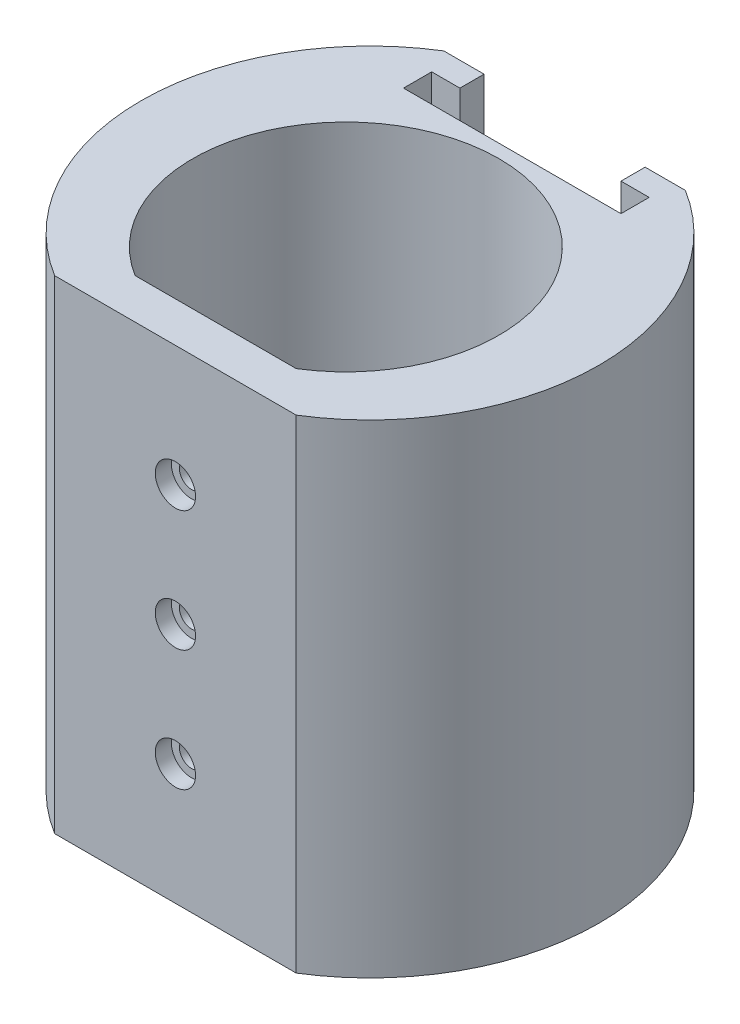
ISO-10303-21;
HEADER;
FILE_DESCRIPTION(('STEP AP214'),'2;1');
FILE_NAME('part.step','',(''),(''),'','','');
FILE_SCHEMA(('AUTOMOTIVE_DESIGN { 1 0 10303 214 1 1 1 1 }'));
ENDSEC;
DATA;
#1=APPLICATION_CONTEXT('core data for automotive mechanical design processes');
#2=APPLICATION_PROTOCOL_DEFINITION('international standard','automotive_design',2000,#1);
#3=PRODUCT_CONTEXT('',#1,'mechanical');
#4=PRODUCT('Part','Part','',(#3));
#5=PRODUCT_RELATED_PRODUCT_CATEGORY('part','',(#4));
#6=PRODUCT_DEFINITION_FORMATION('','',#4);
#7=PRODUCT_DEFINITION_CONTEXT('part definition',#1,'design');
#8=PRODUCT_DEFINITION('design','',#6,#7);
#9=PRODUCT_DEFINITION_SHAPE('','',#8);
#10=(LENGTH_UNIT() NAMED_UNIT(*) SI_UNIT(.MILLI.,.METRE.));
#11=(NAMED_UNIT(*) PLANE_ANGLE_UNIT() SI_UNIT($,.RADIAN.));
#12=(NAMED_UNIT(*) SI_UNIT($,.STERADIAN.) SOLID_ANGLE_UNIT());
#13=UNCERTAINTY_MEASURE_WITH_UNIT(LENGTH_MEASURE(1.E-05),#10,'distance_accuracy_value','');
#14=(GEOMETRIC_REPRESENTATION_CONTEXT(3) GLOBAL_UNCERTAINTY_ASSIGNED_CONTEXT((#13)) GLOBAL_UNIT_ASSIGNED_CONTEXT((#10,
#11,#12)) REPRESENTATION_CONTEXT('',''));
#15=CARTESIAN_POINT('',(0.,0.,0.));
#16=DIRECTION('',(0.,0.,1.));
#17=DIRECTION('',(1.,0.,0.));
#18=AXIS2_PLACEMENT_3D('',#15,#16,#17);
#19=CARTESIAN_POINT('',(0.,-15.,11.9187337903192));
#20=DIRECTION('',(0.,0.,1.));
#21=DIRECTION('',(1.,0.,0.));
#22=AXIS2_PLACEMENT_3D('',#19,#20,#21);
#23=CYLINDRICAL_SURFACE('',#22,1.5);
#24=CARTESIAN_POINT('',(0.,-15.,16.1613744774385));
#25=DIRECTION('',(0.,0.,-1.));
#26=DIRECTION('',(-1.,0.,0.));
#27=AXIS2_PLACEMENT_3D('',#24,#25,#26);
#28=CIRCLE('',#27,1.5);
#29=CARTESIAN_POINT('',(-1.5,-15.,16.1613744774385));
#30=VERTEX_POINT('',#29);
#31=EDGE_CURVE('E279',#30,#30,#28,.F.);
#32=ORIENTED_EDGE('',*,*,#31,.F.);
#33=EDGE_LOOP('',(#32));
#34=FACE_BOUND('',#33,.T.);
#35=CARTESIAN_POINT('',(0.,-15.,19.1613744774385));
#36=DIRECTION('',(0.,0.,1.));
#37=DIRECTION('',(1.,0.,0.));
#38=AXIS2_PLACEMENT_3D('',#35,#36,#37);
#39=CIRCLE('',#38,1.5);
#40=CARTESIAN_POINT('',(1.5,-15.,19.1613744774385));
#41=VERTEX_POINT('',#40);
#42=EDGE_CURVE('E288',#41,#41,#39,.T.);
#43=ORIENTED_EDGE('',*,*,#42,.T.);
#44=EDGE_LOOP('',(#43));
#45=FACE_BOUND('',#44,.T.);
#46=ADVANCED_FACE('F41',(#34,#45),#23,.F.);
#47=CARTESIAN_POINT('',(0.,15.,11.9187337903192));
#48=DIRECTION('',(0.,0.,1.));
#49=DIRECTION('',(1.,0.,0.));
#50=AXIS2_PLACEMENT_3D('',#47,#48,#49);
#51=CYLINDRICAL_SURFACE('',#50,1.5);
#52=CARTESIAN_POINT('',(0.,15.,16.1613744774385));
#53=DIRECTION('',(0.,0.,-1.));
#54=DIRECTION('',(-1.,0.,0.));
#55=AXIS2_PLACEMENT_3D('',#52,#53,#54);
#56=CIRCLE('',#55,1.5);
#57=CARTESIAN_POINT('',(-1.5,15.,16.1613744774385));
#58=VERTEX_POINT('',#57);
#59=EDGE_CURVE('E274',#58,#58,#56,.F.);
#60=ORIENTED_EDGE('',*,*,#59,.F.);
#61=EDGE_LOOP('',(#60));
#62=FACE_BOUND('',#61,.T.);
#63=CARTESIAN_POINT('',(0.,15.,19.1613744774385));
#64=DIRECTION('',(0.,0.,1.));
#65=DIRECTION('',(1.,0.,0.));
#66=AXIS2_PLACEMENT_3D('',#63,#64,#65);
#67=CIRCLE('',#66,1.5);
#68=CARTESIAN_POINT('',(1.5,15.,19.1613744774385));
#69=VERTEX_POINT('',#68);
#70=EDGE_CURVE('E297',#69,#69,#67,.T.);
#71=ORIENTED_EDGE('',*,*,#70,.T.);
#72=EDGE_LOOP('',(#71));
#73=FACE_BOUND('',#72,.T.);
#74=ADVANCED_FACE('F303',(#62,#73),#51,.F.);
#75=CARTESIAN_POINT('',(0.,0.,11.9187337903192));
#76=DIRECTION('',(0.,0.,1.));
#77=DIRECTION('',(1.,0.,0.));
#78=AXIS2_PLACEMENT_3D('',#75,#76,#77);
#79=CYLINDRICAL_SURFACE('',#78,1.5);
#80=CARTESIAN_POINT('',(0.,0.,16.1613744774385));
#81=DIRECTION('',(0.,0.,-1.));
#82=DIRECTION('',(-1.,0.,0.));
#83=AXIS2_PLACEMENT_3D('',#80,#81,#82);
#84=CIRCLE('',#83,1.5);
#85=CARTESIAN_POINT('',(-1.5,0.,16.1613744774385));
#86=VERTEX_POINT('',#85);
#87=EDGE_CURVE('E167',#86,#86,#84,.F.);
#88=ORIENTED_EDGE('',*,*,#87,.F.);
#89=EDGE_LOOP('',(#88));
#90=FACE_BOUND('',#89,.T.);
#91=CARTESIAN_POINT('',(0.,0.,19.1613744774385));
#92=DIRECTION('',(0.,0.,1.));
#93=DIRECTION('',(1.,0.,0.));
#94=AXIS2_PLACEMENT_3D('',#91,#92,#93);
#95=CIRCLE('',#94,1.5);
#96=CARTESIAN_POINT('',(1.5,0.,19.1613744774385));
#97=VERTEX_POINT('',#96);
#98=EDGE_CURVE('E273',#97,#97,#95,.T.);
#99=ORIENTED_EDGE('',*,*,#98,.T.);
#100=EDGE_LOOP('',(#99));
#101=FACE_BOUND('',#100,.T.);
#102=ADVANCED_FACE('F365',(#90,#101),#79,.F.);
#103=CARTESIAN_POINT('',(0.,30.,-3.));
#104=DIRECTION('',(0.,1.,0.));
#105=DIRECTION('',(0.,0.,1.));
#106=AXIS2_PLACEMENT_3D('',#103,#104,#105);
#107=PLANE('',#106);
#108=DIRECTION('',(0.,0.,-1.));
#109=VECTOR('',#108,1.);
#110=CARTESIAN_POINT('',(10.,30.,-24.1613744774385));
#111=LINE('',#110,#109);
#112=CARTESIAN_POINT('',(10.,30.,-24.1613744774385));
#113=VERTEX_POINT('',#112);
#114=CARTESIAN_POINT('',(10.,30.,-27.1613744774385));
#115=VERTEX_POINT('',#114);
#116=EDGE_CURVE('E155',#113,#115,#111,.T.);
#117=ORIENTED_EDGE('',*,*,#116,.F.);
#118=DIRECTION('',(-1.,0.,0.));
#119=VECTOR('',#118,1.);
#120=CARTESIAN_POINT('',(13.5,30.,-24.1613744774385));
#121=LINE('',#120,#119);
#122=CARTESIAN_POINT('',(13.5,30.,-24.1613744774385));
#123=VERTEX_POINT('',#122);
#124=EDGE_CURVE('E242',#123,#113,#121,.T.);
#125=ORIENTED_EDGE('',*,*,#124,.F.);
#126=DIRECTION('',(0.,0.,-1.));
#127=VECTOR('',#126,1.);
#128=CARTESIAN_POINT('',(13.5,30.,-20.6613744774385));
#129=LINE('',#128,#127);
#130=CARTESIAN_POINT('',(13.5,30.,-20.6613744774385));
#131=VERTEX_POINT('',#130);
#132=EDGE_CURVE('E245',#131,#123,#129,.T.);
#133=ORIENTED_EDGE('',*,*,#132,.F.);
#134=DIRECTION('',(1.,0.,0.));
#135=VECTOR('',#134,1.);
#136=CARTESIAN_POINT('',(-13.5,30.,-20.6613744774385));
#137=LINE('',#136,#135);
#138=CARTESIAN_POINT('',(-13.5,30.,-20.6613744774385));
#139=VERTEX_POINT('',#138);
#140=EDGE_CURVE('E248',#139,#131,#137,.T.);
#141=ORIENTED_EDGE('',*,*,#140,.F.);
#142=DIRECTION('',(0.,0.,1.));
#143=VECTOR('',#142,1.);
#144=CARTESIAN_POINT('',(-13.5,30.,-24.1613744774385));
#145=LINE('',#144,#143);
#146=CARTESIAN_POINT('',(-13.5,30.,-24.1613744774385));
#147=VERTEX_POINT('',#146);
#148=EDGE_CURVE('E251',#147,#139,#145,.T.);
#149=ORIENTED_EDGE('',*,*,#148,.F.);
#150=DIRECTION('',(-1.,0.,0.));
#151=VECTOR('',#150,1.);
#152=CARTESIAN_POINT('',(-10.,30.,-24.1613744774385));
#153=LINE('',#152,#151);
#154=CARTESIAN_POINT('',(-10.,30.,-24.1613744774385));
#155=VERTEX_POINT('',#154);
#156=EDGE_CURVE('E166',#155,#147,#153,.T.);
#157=ORIENTED_EDGE('',*,*,#156,.F.);
#158=DIRECTION('',(0.,0.,1.));
#159=VECTOR('',#158,1.);
#160=CARTESIAN_POINT('',(-10.,30.,-27.1613744774385));
#161=LINE('',#160,#159);
#162=CARTESIAN_POINT('',(-10.,30.,-27.1613744774385));
#163=VERTEX_POINT('',#162);
#164=EDGE_CURVE('E146',#163,#155,#161,.T.);
#165=ORIENTED_EDGE('',*,*,#164,.F.);
#166=DIRECTION('',(-1.,0.,0.));
#167=VECTOR('',#166,1.);
#168=CARTESIAN_POINT('',(-15.,30.,-27.1613744774385));
#169=LINE('',#168,#167);
#170=CARTESIAN_POINT('',(-15.,30.,-27.1613744774385));
#171=VERTEX_POINT('',#170);
#172=EDGE_CURVE('E162',#163,#171,#169,.T.);
#173=ORIENTED_EDGE('',*,*,#172,.T.);
#174=CARTESIAN_POINT('',(0.,30.,-3.));
#175=DIRECTION('',(0.,1.,0.));
#176=DIRECTION('',(0.,0.,1.));
#177=AXIS2_PLACEMENT_3D('',#174,#175,#176);
#178=CIRCLE('',#177,28.4389172902031);
#179=CARTESIAN_POINT('',(-15.,30.,21.1613744774385));
#180=VERTEX_POINT('',#179);
#181=EDGE_CURVE('E190',#171,#180,#178,.T.);
#182=ORIENTED_EDGE('',*,*,#181,.T.);
#183=DIRECTION('',(1.,0.,0.));
#184=VECTOR('',#183,1.);
#185=CARTESIAN_POINT('',(-15.,30.,21.1613744774385));
#186=LINE('',#185,#184);
#187=CARTESIAN_POINT('',(15.,30.,21.1613744774385));
#188=VERTEX_POINT('',#187);
#189=EDGE_CURVE('E177',#180,#188,#186,.T.);
#190=ORIENTED_EDGE('',*,*,#189,.T.);
#191=CARTESIAN_POINT('',(0.,30.,-3.));
#192=DIRECTION('',(0.,1.,0.));
#193=DIRECTION('',(0.,0.,1.));
#194=AXIS2_PLACEMENT_3D('',#191,#192,#193);
#195=CIRCLE('',#194,28.4389172902031);
#196=CARTESIAN_POINT('',(15.,30.,-27.1613744774385));
#197=VERTEX_POINT('',#196);
#198=EDGE_CURVE('E174',#188,#197,#195,.T.);
#199=ORIENTED_EDGE('',*,*,#198,.T.);
#200=EDGE_CURVE('E173',#197,#115,#169,.T.);
#201=ORIENTED_EDGE('',*,*,#200,.T.);
#202=EDGE_LOOP('',(#117,#125,#133,#141,#149,#157,#165,#173,#182,#190,#199,#201));
#203=FACE_BOUND('',#202,.T.);
#204=DIRECTION('',(1.,0.,0.));
#205=VECTOR('',#204,1.);
#206=CARTESIAN_POINT('',(-10.,30.,16.1613744774385));
#207=LINE('',#206,#205);
#208=CARTESIAN_POINT('',(-10.,30.,16.1613744774385));
#209=VERTEX_POINT('',#208);
#210=CARTESIAN_POINT('',(10.,30.,16.1613744774385));
#211=VERTEX_POINT('',#210);
#212=EDGE_CURVE('E216',#209,#211,#207,.T.);
#213=ORIENTED_EDGE('',*,*,#212,.F.);
#214=CARTESIAN_POINT('',(0.,30.,0.));
#215=DIRECTION('',(0.,1.,0.));
#216=DIRECTION('',(0.,0.,1.));
#217=AXIS2_PLACEMENT_3D('',#214,#215,#216);
#218=CIRCLE('',#217,19.005);
#219=EDGE_CURVE('E220',#211,#209,#218,.T.);
#220=ORIENTED_EDGE('',*,*,#219,.F.);
#221=EDGE_LOOP('',(#213,#220));
#222=FACE_BOUND('',#221,.T.);
#223=ADVANCED_FACE('F159',(#203,#222),#107,.T.);
#224=CARTESIAN_POINT('',(0.,-30.,-3.));
#225=DIRECTION('',(0.,1.,0.));
#226=DIRECTION('',(0.,0.,1.));
#227=AXIS2_PLACEMENT_3D('',#224,#225,#226);
#228=PLANE('',#227);
#229=CARTESIAN_POINT('',(0.,-30.,-3.));
#230=DIRECTION('',(0.,1.,0.));
#231=DIRECTION('',(0.,0.,1.));
#232=AXIS2_PLACEMENT_3D('',#229,#230,#231);
#233=CIRCLE('',#232,28.4389172902031);
#234=CARTESIAN_POINT('',(-15.,-30.,-27.1613744774385));
#235=VERTEX_POINT('',#234);
#236=CARTESIAN_POINT('',(-15.,-30.,21.1613744774385));
#237=VERTEX_POINT('',#236);
#238=EDGE_CURVE('E181',#235,#237,#233,.T.);
#239=ORIENTED_EDGE('',*,*,#238,.F.);
#240=DIRECTION('',(-1.,0.,0.));
#241=VECTOR('',#240,1.);
#242=CARTESIAN_POINT('',(-15.,-30.,-27.1613744774385));
#243=LINE('',#242,#241);
#244=CARTESIAN_POINT('',(15.,-30.,-27.1613744774385));
#245=VERTEX_POINT('',#244);
#246=EDGE_CURVE('E188',#245,#235,#243,.T.);
#247=ORIENTED_EDGE('',*,*,#246,.F.);
#248=CARTESIAN_POINT('',(0.,-30.,-3.));
#249=DIRECTION('',(0.,1.,0.));
#250=DIRECTION('',(0.,0.,1.));
#251=AXIS2_PLACEMENT_3D('',#248,#249,#250);
#252=CIRCLE('',#251,28.4389172902031);
#253=CARTESIAN_POINT('',(15.,-30.,21.1613744774385));
#254=VERTEX_POINT('',#253);
#255=EDGE_CURVE('E186',#254,#245,#252,.T.);
#256=ORIENTED_EDGE('',*,*,#255,.F.);
#257=DIRECTION('',(1.,0.,0.));
#258=VECTOR('',#257,1.);
#259=CARTESIAN_POINT('',(-15.,-30.,21.1613744774385));
#260=LINE('',#259,#258);
#261=EDGE_CURVE('E184',#237,#254,#260,.T.);
#262=ORIENTED_EDGE('',*,*,#261,.F.);
#263=EDGE_LOOP('',(#239,#247,#256,#262));
#264=FACE_BOUND('',#263,.T.);
#265=CARTESIAN_POINT('',(0.,-30.,0.));
#266=DIRECTION('',(0.,1.,0.));
#267=DIRECTION('',(0.,0.,1.));
#268=AXIS2_PLACEMENT_3D('',#265,#266,#267);
#269=CIRCLE('',#268,19.005);
#270=CARTESIAN_POINT('',(10.,-30.,16.1613744774385));
#271=VERTEX_POINT('',#270);
#272=CARTESIAN_POINT('',(-10.,-30.,16.1613744774385));
#273=VERTEX_POINT('',#272);
#274=EDGE_CURVE('E221',#271,#273,#269,.T.);
#275=ORIENTED_EDGE('',*,*,#274,.T.);
#276=DIRECTION('',(1.,0.,0.));
#277=VECTOR('',#276,1.);
#278=CARTESIAN_POINT('',(-10.,-30.,16.1613744774385));
#279=LINE('',#278,#277);
#280=EDGE_CURVE('E217',#273,#271,#279,.T.);
#281=ORIENTED_EDGE('',*,*,#280,.T.);
#282=EDGE_LOOP('',(#275,#281));
#283=FACE_BOUND('',#282,.T.);
#284=ADVANCED_FACE('F205',(#264,#283),#228,.F.);
#285=CARTESIAN_POINT('',(0.,30.,-3.));
#286=DIRECTION('',(0.,-1.,0.));
#287=DIRECTION('',(0.,0.,-1.));
#288=AXIS2_PLACEMENT_3D('',#285,#286,#287);
#289=CYLINDRICAL_SURFACE('',#288,28.4389172902031);
#290=ORIENTED_EDGE('',*,*,#238,.T.);
#291=DIRECTION('',(0.,-1.,0.));
#292=VECTOR('',#291,1.);
#293=CARTESIAN_POINT('',(-15.,30.,21.1613744774385));
#294=LINE('',#293,#292);
#295=EDGE_CURVE('E12',#180,#237,#294,.T.);
#296=ORIENTED_EDGE('',*,*,#295,.F.);
#297=ORIENTED_EDGE('',*,*,#181,.F.);
#298=DIRECTION('',(0.,-1.,0.));
#299=VECTOR('',#298,1.);
#300=CARTESIAN_POINT('',(-15.,30.,-27.1613744774385));
#301=LINE('',#300,#299);
#302=EDGE_CURVE('E171',#171,#235,#301,.T.);
#303=ORIENTED_EDGE('',*,*,#302,.T.);
#304=EDGE_LOOP('',(#290,#296,#297,#303));
#305=FACE_BOUND('',#304,.T.);
#306=ADVANCED_FACE('F43',(#305),#289,.T.);
#307=CARTESIAN_POINT('',(-15.,30.,21.1613744774385));
#308=DIRECTION('',(0.,0.,-1.));
#309=DIRECTION('',(-1.,0.,0.));
#310=AXIS2_PLACEMENT_3D('',#307,#308,#309);
#311=PLANE('',#310);
#312=CARTESIAN_POINT('',(0.,15.,21.1613744774385));
#313=DIRECTION('',(0.,0.,1.));
#314=DIRECTION('',(1.,0.,0.));
#315=AXIS2_PLACEMENT_3D('',#312,#313,#314);
#316=CIRCLE('',#315,2.5);
#317=CARTESIAN_POINT('',(2.5,15.,21.1613744774385));
#318=VERTEX_POINT('',#317);
#319=EDGE_CURVE('E292',#318,#318,#316,.T.);
#320=ORIENTED_EDGE('',*,*,#319,.F.);
#321=EDGE_LOOP('',(#320));
#322=FACE_BOUND('',#321,.T.);
#323=CARTESIAN_POINT('',(0.,-15.,21.1613744774385));
#324=DIRECTION('',(0.,0.,1.));
#325=DIRECTION('',(1.,0.,0.));
#326=AXIS2_PLACEMENT_3D('',#323,#324,#325);
#327=CIRCLE('',#326,2.5);
#328=CARTESIAN_POINT('',(2.5,-15.,21.1613744774385));
#329=VERTEX_POINT('',#328);
#330=EDGE_CURVE('E285',#329,#329,#327,.T.);
#331=ORIENTED_EDGE('',*,*,#330,.F.);
#332=EDGE_LOOP('',(#331));
#333=FACE_BOUND('',#332,.T.);
#334=CARTESIAN_POINT('',(0.,0.,21.1613744774385));
#335=DIRECTION('',(0.,0.,1.));
#336=DIRECTION('',(1.,0.,0.));
#337=AXIS2_PLACEMENT_3D('',#334,#335,#336);
#338=CIRCLE('',#337,2.5);
#339=CARTESIAN_POINT('',(2.5,0.,21.1613744774385));
#340=VERTEX_POINT('',#339);
#341=EDGE_CURVE('E270',#340,#340,#338,.T.);
#342=ORIENTED_EDGE('',*,*,#341,.F.);
#343=EDGE_LOOP('',(#342));
#344=FACE_BOUND('',#343,.T.);
#345=ORIENTED_EDGE('',*,*,#261,.T.);
#346=DIRECTION('',(0.,-1.,0.));
#347=VECTOR('',#346,1.);
#348=CARTESIAN_POINT('',(15.,30.,21.1613744774385));
#349=LINE('',#348,#347);
#350=EDGE_CURVE('E49',#188,#254,#349,.T.);
#351=ORIENTED_EDGE('',*,*,#350,.F.);
#352=ORIENTED_EDGE('',*,*,#189,.F.);
#353=ORIENTED_EDGE('',*,*,#295,.T.);
#354=EDGE_LOOP('',(#345,#351,#352,#353));
#355=FACE_BOUND('',#354,.T.);
#356=ADVANCED_FACE('F319',(#322,#333,#344,#355),#311,.F.);
#357=CARTESIAN_POINT('',(0.,30.,-3.));
#358=DIRECTION('',(0.,-1.,0.));
#359=DIRECTION('',(0.,0.,-1.));
#360=AXIS2_PLACEMENT_3D('',#357,#358,#359);
#361=CYLINDRICAL_SURFACE('',#360,28.4389172902031);
#362=ORIENTED_EDGE('',*,*,#255,.T.);
#363=DIRECTION('',(0.,-1.,0.));
#364=VECTOR('',#363,1.);
#365=CARTESIAN_POINT('',(15.,30.,-27.1613744774385));
#366=LINE('',#365,#364);
#367=EDGE_CURVE('E192',#197,#245,#366,.T.);
#368=ORIENTED_EDGE('',*,*,#367,.F.);
#369=ORIENTED_EDGE('',*,*,#198,.F.);
#370=ORIENTED_EDGE('',*,*,#350,.T.);
#371=EDGE_LOOP('',(#362,#368,#369,#370));
#372=FACE_BOUND('',#371,.T.);
#373=ADVANCED_FACE('F199',(#372),#361,.T.);
#374=CARTESIAN_POINT('',(-15.,30.,-27.1613744774385));
#375=DIRECTION('',(0.,0.,1.));
#376=DIRECTION('',(1.,0.,0.));
#377=AXIS2_PLACEMENT_3D('',#374,#375,#376);
#378=PLANE('',#377);
#379=DIRECTION('',(1.,0.,0.));
#380=VECTOR('',#379,1.);
#381=CARTESIAN_POINT('',(10.,-20.,-27.1613744774385));
#382=LINE('',#381,#380);
#383=CARTESIAN_POINT('',(-10.,-20.,-27.1613744774385));
#384=VERTEX_POINT('',#383);
#385=CARTESIAN_POINT('',(10.,-20.,-27.1613744774385));
#386=VERTEX_POINT('',#385);
#387=EDGE_CURVE('E226',#384,#386,#382,.T.);
#388=ORIENTED_EDGE('',*,*,#387,.T.);
#389=DIRECTION('',(0.,1.,0.));
#390=VECTOR('',#389,1.);
#391=CARTESIAN_POINT('',(10.,-57.7713881539976,-27.1613744774385));
#392=LINE('',#391,#390);
#393=EDGE_CURVE('E56',#386,#115,#392,.T.);
#394=ORIENTED_EDGE('',*,*,#393,.T.);
#395=ORIENTED_EDGE('',*,*,#200,.F.);
#396=ORIENTED_EDGE('',*,*,#367,.T.);
#397=ORIENTED_EDGE('',*,*,#246,.T.);
#398=ORIENTED_EDGE('',*,*,#302,.F.);
#399=ORIENTED_EDGE('',*,*,#172,.F.);
#400=DIRECTION('',(0.,1.,0.));
#401=VECTOR('',#400,1.);
#402=CARTESIAN_POINT('',(-10.,-57.7713881539976,-27.1613744774385));
#403=LINE('',#402,#401);
#404=EDGE_CURVE('E142',#384,#163,#403,.T.);
#405=ORIENTED_EDGE('',*,*,#404,.F.);
#406=EDGE_LOOP('',(#388,#394,#395,#396,#397,#398,#399,#405));
#407=FACE_BOUND('',#406,.T.);
#408=ADVANCED_FACE('F169',(#407),#378,.F.);
#409=CARTESIAN_POINT('',(0.,30.,0.));
#410=DIRECTION('',(0.,-1.,0.));
#411=DIRECTION('',(0.,0.,-1.));
#412=AXIS2_PLACEMENT_3D('',#409,#410,#411);
#413=CYLINDRICAL_SURFACE('',#412,19.005);
#414=ORIENTED_EDGE('',*,*,#274,.F.);
#415=DIRECTION('',(0.,-1.,0.));
#416=VECTOR('',#415,1.);
#417=CARTESIAN_POINT('',(10.,30.,16.1613744774385));
#418=LINE('',#417,#416);
#419=EDGE_CURVE('E213',#211,#271,#418,.T.);
#420=ORIENTED_EDGE('',*,*,#419,.F.);
#421=ORIENTED_EDGE('',*,*,#219,.T.);
#422=DIRECTION('',(0.,-1.,0.));
#423=VECTOR('',#422,1.);
#424=CARTESIAN_POINT('',(-10.,30.,16.1613744774385));
#425=LINE('',#424,#423);
#426=EDGE_CURVE('E64',#209,#273,#425,.T.);
#427=ORIENTED_EDGE('',*,*,#426,.T.);
#428=EDGE_LOOP('',(#414,#420,#421,#427));
#429=FACE_BOUND('',#428,.T.);
#430=ADVANCED_FACE('F472',(#429),#413,.F.);
#431=CARTESIAN_POINT('',(-10.,30.,16.1613744774385));
#432=DIRECTION('',(0.,0.,-1.));
#433=DIRECTION('',(-1.,0.,0.));
#434=AXIS2_PLACEMENT_3D('',#431,#432,#433);
#435=PLANE('',#434);
#436=ORIENTED_EDGE('',*,*,#59,.T.);
#437=EDGE_LOOP('',(#436));
#438=FACE_BOUND('',#437,.T.);
#439=ORIENTED_EDGE('',*,*,#31,.T.);
#440=EDGE_LOOP('',(#439));
#441=FACE_BOUND('',#440,.T.);
#442=ORIENTED_EDGE('',*,*,#87,.T.);
#443=EDGE_LOOP('',(#442));
#444=FACE_BOUND('',#443,.T.);
#445=ORIENTED_EDGE('',*,*,#280,.F.);
#446=ORIENTED_EDGE('',*,*,#426,.F.);
#447=ORIENTED_EDGE('',*,*,#212,.T.);
#448=ORIENTED_EDGE('',*,*,#419,.T.);
#449=EDGE_LOOP('',(#445,#446,#447,#448));
#450=FACE_BOUND('',#449,.T.);
#451=ADVANCED_FACE('F386',(#438,#441,#444,#450),#435,.T.);
#452=CARTESIAN_POINT('',(10.,-57.7713881539976,-24.1613744774385));
#453=DIRECTION('',(1.,0.,0.));
#454=DIRECTION('',(0.,0.,-1.));
#455=AXIS2_PLACEMENT_3D('',#452,#453,#454);
#456=PLANE('',#455);
#457=DIRECTION('',(0.,0.,1.));
#458=VECTOR('',#457,1.);
#459=CARTESIAN_POINT('',(10.,-20.,-24.1613744774385));
#460=LINE('',#459,#458);
#461=CARTESIAN_POINT('',(10.,-20.,-24.1613744774385));
#462=VERTEX_POINT('',#461);
#463=EDGE_CURVE('E256',#386,#462,#460,.T.);
#464=ORIENTED_EDGE('',*,*,#463,.T.);
#465=DIRECTION('',(0.,1.,0.));
#466=VECTOR('',#465,1.);
#467=CARTESIAN_POINT('',(10.,-57.7713881539976,-24.1613744774385));
#468=LINE('',#467,#466);
#469=EDGE_CURVE('E237',#462,#113,#468,.T.);
#470=ORIENTED_EDGE('',*,*,#469,.T.);
#471=ORIENTED_EDGE('',*,*,#116,.T.);
#472=ORIENTED_EDGE('',*,*,#393,.F.);
#473=EDGE_LOOP('',(#464,#470,#471,#472));
#474=FACE_BOUND('',#473,.T.);
#475=ADVANCED_FACE('F331',(#474),#456,.F.);
#476=CARTESIAN_POINT('',(13.5,-57.7713881539976,-24.1613744774385));
#477=DIRECTION('',(0.,0.,-1.));
#478=DIRECTION('',(-1.,0.,0.));
#479=AXIS2_PLACEMENT_3D('',#476,#477,#478);
#480=PLANE('',#479);
#481=DIRECTION('',(1.,0.,0.));
#482=VECTOR('',#481,1.);
#483=CARTESIAN_POINT('',(13.5,-20.,-24.1613744774385));
#484=LINE('',#483,#482);
#485=CARTESIAN_POINT('',(13.5,-20.,-24.1613744774385));
#486=VERTEX_POINT('',#485);
#487=EDGE_CURVE('E258',#462,#486,#484,.T.);
#488=ORIENTED_EDGE('',*,*,#487,.T.);
#489=DIRECTION('',(0.,1.,0.));
#490=VECTOR('',#489,1.);
#491=CARTESIAN_POINT('',(13.5,-57.7713881539976,-24.1613744774385));
#492=LINE('',#491,#490);
#493=EDGE_CURVE('E235',#486,#123,#492,.T.);
#494=ORIENTED_EDGE('',*,*,#493,.T.);
#495=ORIENTED_EDGE('',*,*,#124,.T.);
#496=ORIENTED_EDGE('',*,*,#469,.F.);
#497=EDGE_LOOP('',(#488,#494,#495,#496));
#498=FACE_BOUND('',#497,.T.);
#499=ADVANCED_FACE('F334',(#498),#480,.F.);
#500=CARTESIAN_POINT('',(13.5,-57.7713881539976,-20.6613744774385));
#501=DIRECTION('',(1.,0.,0.));
#502=DIRECTION('',(0.,0.,-1.));
#503=AXIS2_PLACEMENT_3D('',#500,#501,#502);
#504=PLANE('',#503);
#505=DIRECTION('',(0.,0.,1.));
#506=VECTOR('',#505,1.);
#507=CARTESIAN_POINT('',(13.5,-20.,-20.6613744774385));
#508=LINE('',#507,#506);
#509=CARTESIAN_POINT('',(13.5,-20.,-20.6613744774385));
#510=VERTEX_POINT('',#509);
#511=EDGE_CURVE('E260',#486,#510,#508,.T.);
#512=ORIENTED_EDGE('',*,*,#511,.T.);
#513=DIRECTION('',(0.,1.,0.));
#514=VECTOR('',#513,1.);
#515=CARTESIAN_POINT('',(13.5,-57.7713881539976,-20.6613744774385));
#516=LINE('',#515,#514);
#517=EDGE_CURVE('E233',#510,#131,#516,.T.);
#518=ORIENTED_EDGE('',*,*,#517,.T.);
#519=ORIENTED_EDGE('',*,*,#132,.T.);
#520=ORIENTED_EDGE('',*,*,#493,.F.);
#521=EDGE_LOOP('',(#512,#518,#519,#520));
#522=FACE_BOUND('',#521,.T.);
#523=ADVANCED_FACE('F339',(#522),#504,.F.);
#524=CARTESIAN_POINT('',(-13.5,-57.7713881539976,-20.6613744774385));
#525=DIRECTION('',(0.,0.,1.));
#526=DIRECTION('',(1.,0.,0.));
#527=AXIS2_PLACEMENT_3D('',#524,#525,#526);
#528=PLANE('',#527);
#529=DIRECTION('',(-1.,0.,0.));
#530=VECTOR('',#529,1.);
#531=CARTESIAN_POINT('',(-13.5,-20.,-20.6613744774385));
#532=LINE('',#531,#530);
#533=CARTESIAN_POINT('',(-13.5,-20.,-20.6613744774385));
#534=VERTEX_POINT('',#533);
#535=EDGE_CURVE('E262',#510,#534,#532,.T.);
#536=ORIENTED_EDGE('',*,*,#535,.T.);
#537=DIRECTION('',(0.,1.,0.));
#538=VECTOR('',#537,1.);
#539=CARTESIAN_POINT('',(-13.5,-57.7713881539976,-20.6613744774385));
#540=LINE('',#539,#538);
#541=EDGE_CURVE('E231',#534,#139,#540,.T.);
#542=ORIENTED_EDGE('',*,*,#541,.T.);
#543=ORIENTED_EDGE('',*,*,#140,.T.);
#544=ORIENTED_EDGE('',*,*,#517,.F.);
#545=EDGE_LOOP('',(#536,#542,#543,#544));
#546=FACE_BOUND('',#545,.T.);
#547=ADVANCED_FACE('F343',(#546),#528,.F.);
#548=CARTESIAN_POINT('',(-13.5,-57.7713881539976,-24.1613744774385));
#549=DIRECTION('',(-1.,0.,0.));
#550=DIRECTION('',(0.,0.,1.));
#551=AXIS2_PLACEMENT_3D('',#548,#549,#550);
#552=PLANE('',#551);
#553=DIRECTION('',(0.,0.,-1.));
#554=VECTOR('',#553,1.);
#555=CARTESIAN_POINT('',(-13.5,-20.,-24.1613744774385));
#556=LINE('',#555,#554);
#557=CARTESIAN_POINT('',(-13.5,-20.,-24.1613744774385));
#558=VERTEX_POINT('',#557);
#559=EDGE_CURVE('E264',#534,#558,#556,.T.);
#560=ORIENTED_EDGE('',*,*,#559,.T.);
#561=DIRECTION('',(0.,1.,0.));
#562=VECTOR('',#561,1.);
#563=CARTESIAN_POINT('',(-13.5,-57.7713881539976,-24.1613744774385));
#564=LINE('',#563,#562);
#565=EDGE_CURVE('E229',#558,#147,#564,.T.);
#566=ORIENTED_EDGE('',*,*,#565,.T.);
#567=ORIENTED_EDGE('',*,*,#148,.T.);
#568=ORIENTED_EDGE('',*,*,#541,.F.);
#569=EDGE_LOOP('',(#560,#566,#567,#568));
#570=FACE_BOUND('',#569,.T.);
#571=ADVANCED_FACE('F347',(#570),#552,.F.);
#572=CARTESIAN_POINT('',(-10.,-57.7713881539976,-24.1613744774385));
#573=DIRECTION('',(0.,0.,-1.));
#574=DIRECTION('',(-1.,0.,0.));
#575=AXIS2_PLACEMENT_3D('',#572,#573,#574);
#576=PLANE('',#575);
#577=DIRECTION('',(1.,0.,0.));
#578=VECTOR('',#577,1.);
#579=CARTESIAN_POINT('',(-10.,-20.,-24.1613744774385));
#580=LINE('',#579,#578);
#581=CARTESIAN_POINT('',(-10.,-20.,-24.1613744774385));
#582=VERTEX_POINT('',#581);
#583=EDGE_CURVE('E240',#558,#582,#580,.T.);
#584=ORIENTED_EDGE('',*,*,#583,.T.);
#585=DIRECTION('',(0.,1.,0.));
#586=VECTOR('',#585,1.);
#587=CARTESIAN_POINT('',(-10.,-57.7713881539976,-24.1613744774385));
#588=LINE('',#587,#586);
#589=EDGE_CURVE('E154',#582,#155,#588,.T.);
#590=ORIENTED_EDGE('',*,*,#589,.T.);
#591=ORIENTED_EDGE('',*,*,#156,.T.);
#592=ORIENTED_EDGE('',*,*,#565,.F.);
#593=EDGE_LOOP('',(#584,#590,#591,#592));
#594=FACE_BOUND('',#593,.T.);
#595=ADVANCED_FACE('F350',(#594),#576,.F.);
#596=CARTESIAN_POINT('',(-10.,-57.7713881539976,-27.1613744774385));
#597=DIRECTION('',(-1.,0.,0.));
#598=DIRECTION('',(0.,0.,1.));
#599=AXIS2_PLACEMENT_3D('',#596,#597,#598);
#600=PLANE('',#599);
#601=DIRECTION('',(0.,0.,-1.));
#602=VECTOR('',#601,1.);
#603=CARTESIAN_POINT('',(-10.,-20.,-27.1613744774385));
#604=LINE('',#603,#602);
#605=EDGE_CURVE('E149',#582,#384,#604,.T.);
#606=ORIENTED_EDGE('',*,*,#605,.T.);
#607=ORIENTED_EDGE('',*,*,#404,.T.);
#608=ORIENTED_EDGE('',*,*,#164,.T.);
#609=ORIENTED_EDGE('',*,*,#589,.F.);
#610=EDGE_LOOP('',(#606,#607,#608,#609));
#611=FACE_BOUND('',#610,.T.);
#612=ADVANCED_FACE('F144',(#611),#600,.F.);
#613=CARTESIAN_POINT('',(0.,-20.,-3.));
#614=DIRECTION('',(0.,1.,0.));
#615=DIRECTION('',(0.,0.,1.));
#616=AXIS2_PLACEMENT_3D('',#613,#614,#615);
#617=PLANE('',#616);
#618=ORIENTED_EDGE('',*,*,#387,.F.);
#619=ORIENTED_EDGE('',*,*,#605,.F.);
#620=ORIENTED_EDGE('',*,*,#583,.F.);
#621=ORIENTED_EDGE('',*,*,#559,.F.);
#622=ORIENTED_EDGE('',*,*,#535,.F.);
#623=ORIENTED_EDGE('',*,*,#511,.F.);
#624=ORIENTED_EDGE('',*,*,#487,.F.);
#625=ORIENTED_EDGE('',*,*,#463,.F.);
#626=EDGE_LOOP('',(#618,#619,#620,#621,#622,#623,#624,#625));
#627=FACE_BOUND('',#626,.T.);
#628=ADVANCED_FACE('F326',(#627),#617,.T.);
#629=CARTESIAN_POINT('',(0.,0.,19.1613744774385));
#630=DIRECTION('',(0.,0.,1.));
#631=DIRECTION('',(1.,0.,0.));
#632=AXIS2_PLACEMENT_3D('',#629,#630,#631);
#633=CYLINDRICAL_SURFACE('',#632,2.5);
#634=CARTESIAN_POINT('',(0.,0.,19.1613744774385));
#635=DIRECTION('',(0.,0.,1.));
#636=DIRECTION('',(1.,0.,0.));
#637=AXIS2_PLACEMENT_3D('',#634,#635,#636);
#638=CIRCLE('',#637,2.5);
#639=CARTESIAN_POINT('',(2.5,0.,19.1613744774385));
#640=VERTEX_POINT('',#639);
#641=EDGE_CURVE('E269',#640,#640,#638,.T.);
#642=ORIENTED_EDGE('',*,*,#641,.F.);
#643=EDGE_LOOP('',(#642));
#644=FACE_BOUND('',#643,.T.);
#645=ORIENTED_EDGE('',*,*,#341,.T.);
#646=EDGE_LOOP('',(#645));
#647=FACE_BOUND('',#646,.T.);
#648=ADVANCED_FACE('F374',(#644,#647),#633,.F.);
#649=CARTESIAN_POINT('',(0.,0.,19.1613744774385));
#650=DIRECTION('',(0.,0.,1.));
#651=DIRECTION('',(1.,0.,0.));
#652=AXIS2_PLACEMENT_3D('',#649,#650,#651);
#653=PLANE('',#652);
#654=ORIENTED_EDGE('',*,*,#98,.F.);
#655=EDGE_LOOP('',(#654));
#656=FACE_BOUND('',#655,.T.);
#657=ORIENTED_EDGE('',*,*,#641,.T.);
#658=EDGE_LOOP('',(#657));
#659=FACE_BOUND('',#658,.T.);
#660=ADVANCED_FACE('F315',(#656,#659),#653,.T.);
#661=CARTESIAN_POINT('',(0.,15.,19.1613744774385));
#662=DIRECTION('',(0.,0.,1.));
#663=DIRECTION('',(1.,0.,0.));
#664=AXIS2_PLACEMENT_3D('',#661,#662,#663);
#665=CYLINDRICAL_SURFACE('',#664,2.5);
#666=CARTESIAN_POINT('',(0.,15.,19.1613744774385));
#667=DIRECTION('',(0.,0.,1.));
#668=DIRECTION('',(1.,0.,0.));
#669=AXIS2_PLACEMENT_3D('',#666,#667,#668);
#670=CIRCLE('',#669,2.5);
#671=CARTESIAN_POINT('',(2.5,15.,19.1613744774385));
#672=VERTEX_POINT('',#671);
#673=EDGE_CURVE('E282',#672,#672,#670,.T.);
#674=ORIENTED_EDGE('',*,*,#673,.F.);
#675=EDGE_LOOP('',(#674));
#676=FACE_BOUND('',#675,.T.);
#677=ORIENTED_EDGE('',*,*,#319,.T.);
#678=EDGE_LOOP('',(#677));
#679=FACE_BOUND('',#678,.T.);
#680=ADVANCED_FACE('F309',(#676,#679),#665,.F.);
#681=CARTESIAN_POINT('',(0.,15.,19.1613744774385));
#682=DIRECTION('',(0.,0.,1.));
#683=DIRECTION('',(1.,0.,0.));
#684=AXIS2_PLACEMENT_3D('',#681,#682,#683);
#685=PLANE('',#684);
#686=ORIENTED_EDGE('',*,*,#70,.F.);
#687=EDGE_LOOP('',(#686));
#688=FACE_BOUND('',#687,.T.);
#689=ORIENTED_EDGE('',*,*,#673,.T.);
#690=EDGE_LOOP('',(#689));
#691=FACE_BOUND('',#690,.T.);
#692=ADVANCED_FACE('F305',(#688,#691),#685,.T.);
#693=CARTESIAN_POINT('',(0.,-15.,19.1613744774385));
#694=DIRECTION('',(0.,0.,1.));
#695=DIRECTION('',(1.,0.,0.));
#696=AXIS2_PLACEMENT_3D('',#693,#694,#695);
#697=CYLINDRICAL_SURFACE('',#696,2.5);
#698=CARTESIAN_POINT('',(0.,-15.,19.1613744774385));
#699=DIRECTION('',(0.,0.,1.));
#700=DIRECTION('',(1.,0.,0.));
#701=AXIS2_PLACEMENT_3D('',#698,#699,#700);
#702=CIRCLE('',#701,2.5);
#703=CARTESIAN_POINT('',(2.5,-15.,19.1613744774385));
#704=VERTEX_POINT('',#703);
#705=EDGE_CURVE('E289',#704,#704,#702,.T.);
#706=ORIENTED_EDGE('',*,*,#705,.F.);
#707=EDGE_LOOP('',(#706));
#708=FACE_BOUND('',#707,.T.);
#709=ORIENTED_EDGE('',*,*,#330,.T.);
#710=EDGE_LOOP('',(#709));
#711=FACE_BOUND('',#710,.T.);
#712=ADVANCED_FACE('F308',(#708,#711),#697,.F.);
#713=CARTESIAN_POINT('',(0.,-15.,19.1613744774385));
#714=DIRECTION('',(0.,0.,1.));
#715=DIRECTION('',(1.,0.,0.));
#716=AXIS2_PLACEMENT_3D('',#713,#714,#715);
#717=PLANE('',#716);
#718=ORIENTED_EDGE('',*,*,#42,.F.);
#719=EDGE_LOOP('',(#718));
#720=FACE_BOUND('',#719,.T.);
#721=ORIENTED_EDGE('',*,*,#705,.T.);
#722=EDGE_LOOP('',(#721));
#723=FACE_BOUND('',#722,.T.);
#724=ADVANCED_FACE('F499',(#720,#723),#717,.T.);
#725=CLOSED_SHELL('',(#46,#74,#102,#223,#284,#306,#356,#373,#408,#430,#451,#475,#499,#523,#547,
#571,#595,#612,#628,#648,#660,#680,#692,#712,#724));
#726=MANIFOLD_SOLID_BREP('B2',#725);
#727=ADVANCED_BREP_SHAPE_REPRESENTATION('',(#18,#726),#14);
#728=SHAPE_DEFINITION_REPRESENTATION(#9,#727);
ENDSEC;
END-ISO-10303-21;
